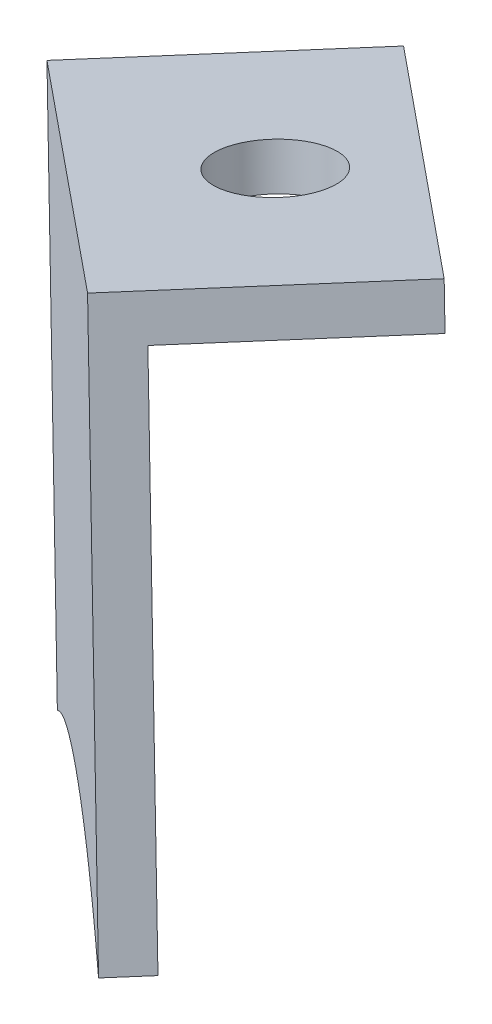
ISO-10303-21;
HEADER;
FILE_DESCRIPTION(('STEP AP214'),'2;1');
FILE_NAME('part.step','',(''),(''),'','','');
FILE_SCHEMA(('AUTOMOTIVE_DESIGN { 1 0 10303 214 1 1 1 1 }'));
ENDSEC;
DATA;
#1=APPLICATION_CONTEXT('core data for automotive mechanical design processes');
#2=APPLICATION_PROTOCOL_DEFINITION('international standard','automotive_design',2000,#1);
#3=PRODUCT_CONTEXT('',#1,'mechanical');
#4=PRODUCT('Part','Part','',(#3));
#5=PRODUCT_RELATED_PRODUCT_CATEGORY('part','',(#4));
#6=PRODUCT_DEFINITION_FORMATION('','',#4);
#7=PRODUCT_DEFINITION_CONTEXT('part definition',#1,'design');
#8=PRODUCT_DEFINITION('design','',#6,#7);
#9=PRODUCT_DEFINITION_SHAPE('','',#8);
#10=(LENGTH_UNIT() NAMED_UNIT(*) SI_UNIT(.MILLI.,.METRE.));
#11=(NAMED_UNIT(*) PLANE_ANGLE_UNIT() SI_UNIT($,.RADIAN.));
#12=(NAMED_UNIT(*) SI_UNIT($,.STERADIAN.) SOLID_ANGLE_UNIT());
#13=UNCERTAINTY_MEASURE_WITH_UNIT(LENGTH_MEASURE(1.E-05),#10,'distance_accuracy_value','');
#14=(GEOMETRIC_REPRESENTATION_CONTEXT(3) GLOBAL_UNCERTAINTY_ASSIGNED_CONTEXT((#13)) GLOBAL_UNIT_ASSIGNED_CONTEXT((#10,
#11,#12)) REPRESENTATION_CONTEXT('',''));
#15=CARTESIAN_POINT('',(0.,0.,0.));
#16=DIRECTION('',(0.,0.,1.));
#17=DIRECTION('',(1.,0.,0.));
#18=AXIS2_PLACEMENT_3D('',#15,#16,#17);
#19=CARTESIAN_POINT('',(909.399199225308,-359.189028773466,416.160760837431));
#20=DIRECTION('',(0.656059028990508,0.,-0.754709580222772));
#21=DIRECTION('',(-0.754709580222772,0.,-0.656059028990508));
#22=AXIS2_PLACEMENT_3D('',#19,#20,#21);
#23=PLANE('',#22);
#24=DIRECTION('',(-0.159336639189074,0.97745947709662,-0.138509227295271));
#25=VECTOR('',#24,1.);
#26=CARTESIAN_POINT('',(914.320802830597,-343.23861305799,420.439045580297));
#27=LINE('',#26,#25);
#28=CARTESIAN_POINT('',(914.320802830597,-343.23861305799,420.439045580297));
#29=VERTEX_POINT('',#28);
#30=CARTESIAN_POINT('',(910.858746443077,-322.000435552509,417.429525877054));
#31=VERTEX_POINT('',#30);
#32=EDGE_CURVE('E52',#29,#31,#27,.T.);
#33=ORIENTED_EDGE('',*,*,#32,.T.);
#34=DIRECTION('',(-0.73769803164436,-0.211123117242059,-0.641271115421576));
#35=VECTOR('',#34,1.);
#36=CARTESIAN_POINT('',(925.612707075965,-317.777973207667,430.254948185486));
#37=LINE('',#36,#35);
#38=CARTESIAN_POINT('',(925.612707075965,-317.777973207667,430.254948185486));
#39=VERTEX_POINT('',#38);
#40=EDGE_CURVE('E138',#39,#31,#37,.T.);
#41=ORIENTED_EDGE('',*,*,#40,.F.);
#42=DIRECTION('',(0.159336639189074,-0.97745947709662,0.138509227295272));
#43=VECTOR('',#42,1.);
#44=CARTESIAN_POINT('',(929.277449777312,-340.25954118089,433.440660413277));
#45=LINE('',#44,#43);
#46=CARTESIAN_POINT('',(929.277449777312,-340.25954118089,433.440660413277));
#47=VERTEX_POINT('',#46);
#48=EDGE_CURVE('E58',#39,#47,#45,.T.);
#49=ORIENTED_EDGE('',*,*,#48,.T.);
#50=CARTESIAN_POINT('',(933.22503689066,-345.357596421036,436.872245537284));
#51=CARTESIAN_POINT('',(925.653414901661,-322.458928477497,430.290334958489));
#52=CARTESIAN_POINT('',(901.827577236309,-336.290360829927,409.578850258637));
#53=CARTESIAN_POINT('',(909.399199225308,-359.189028773466,416.160760837431));
#54=CARTESIAN_POINT('',(916.970821214307,-382.087696717005,422.742671416226));
#55=CARTESIAN_POINT('',(940.796658879659,-368.256264364575,443.454156116079));
#56=CARTESIAN_POINT('',(933.22503689066,-345.357596421036,436.872245537284));
#57=(BOUNDED_CURVE() B_SPLINE_CURVE(3,(#50,#51,#52,#53,#54,#55,#56),.UNSPECIFIED.,.T.,
.F.) B_SPLINE_CURVE_WITH_KNOTS((4,3,4),(0.,0.5,1.),
.UNSPECIFIED.) CURVE() GEOMETRIC_REPRESENTATION_ITEM() RATIONAL_B_SPLINE_CURVE((1.,
0.333333333333333,0.333333333333333,1.,0.333333333333333,0.333333333333333,1.)) REPRESENTATION_ITEM(''));
#58=EDGE_CURVE('E88',#47,#29,#57,.T.);
#59=ORIENTED_EDGE('',*,*,#58,.T.);
#60=EDGE_LOOP('',(#33,#41,#49,#59));
#61=FACE_BOUND('',#60,.T.);
#62=ADVANCED_FACE('F36',(#61),#23,.T.);
#63=DIRECTION('',(-0.656059028990508,0.,0.754709580222771));
#64=VECTOR('',#63,1.);
#65=SURFACE_OF_LINEAR_EXTRUSION('',#57,#64);
#66=CARTESIAN_POINT('',(931.912918832679,-345.357596421036,438.38166469773));
#67=CARTESIAN_POINT('',(924.341296843679,-322.458928477497,431.799754118935));
#68=CARTESIAN_POINT('',(900.515459178327,-336.290360829927,411.088269419082));
#69=CARTESIAN_POINT('',(908.087081167327,-359.189028773466,417.670179997877));
#70=CARTESIAN_POINT('',(915.658703156326,-382.087696717005,424.252090576672));
#71=CARTESIAN_POINT('',(939.484540821678,-368.256264364575,444.963575276524));
#72=CARTESIAN_POINT('',(931.912918832679,-345.357596421036,438.38166469773));
#73=(BOUNDED_CURVE() B_SPLINE_CURVE(3,(#66,#67,#68,#69,#70,#71,#72),.UNSPECIFIED.,.T.,
.F.) B_SPLINE_CURVE_WITH_KNOTS((4,3,4),(0.,0.5,1.),
.UNSPECIFIED.) CURVE() GEOMETRIC_REPRESENTATION_ITEM() RATIONAL_B_SPLINE_CURVE((1.,
0.333333333333333,0.333333333333333,1.,0.333333333333333,0.333333333333333,1.)) REPRESENTATION_ITEM(''));
#74=CARTESIAN_POINT('',(927.965331719331,-340.25954118089,434.950079573723));
#75=VERTEX_POINT('',#74);
#76=CARTESIAN_POINT('',(913.008684772616,-343.23861305799,421.948464740743));
#77=VERTEX_POINT('',#76);
#78=EDGE_CURVE('E94',#75,#77,#73,.T.);
#79=ORIENTED_EDGE('',*,*,#78,.T.);
#80=DIRECTION('',(-0.656059028990508,0.,0.754709580222771));
#81=VECTOR('',#80,1.);
#82=CARTESIAN_POINT('',(914.320802830597,-343.23861305799,420.439045580297));
#83=LINE('',#82,#81);
#84=EDGE_CURVE('E11',#29,#77,#83,.T.);
#85=ORIENTED_EDGE('',*,*,#84,.F.);
#86=ORIENTED_EDGE('',*,*,#58,.F.);
#87=DIRECTION('',(-0.656059028990508,0.,0.754709580222771));
#88=VECTOR('',#87,1.);
#89=CARTESIAN_POINT('',(929.277449777312,-340.25954118089,433.440660413277));
#90=LINE('',#89,#88);
#91=EDGE_CURVE('E80',#47,#75,#90,.T.);
#92=ORIENTED_EDGE('',*,*,#91,.T.);
#93=EDGE_LOOP('',(#79,#85,#86,#92));
#94=FACE_BOUND('',#93,.T.);
#95=ADVANCED_FACE('F38',(#94),#65,.F.);
#96=CARTESIAN_POINT('',(914.320802830597,-343.23861305799,420.439045580297));
#97=DIRECTION('',(0.737698031644359,0.211123117242054,0.641271115421579));
#98=DIRECTION('',(0.656059028990508,0.,-0.754709580222771));
#99=AXIS2_PLACEMENT_3D('',#96,#97,#98);
#100=PLANE('',#99);
#101=DIRECTION('',(-0.159336639189074,0.97745947709662,-0.138509227295271));
#102=VECTOR('',#101,1.);
#103=CARTESIAN_POINT('',(913.008684772616,-343.23861305799,421.948464740743));
#104=LINE('',#103,#102);
#105=CARTESIAN_POINT('',(909.227955106717,-320.045516598315,418.661926582909));
#106=VERTEX_POINT('',#105);
#107=EDGE_CURVE('E97',#77,#106,#104,.T.);
#108=ORIENTED_EDGE('',*,*,#107,.T.);
#109=DIRECTION('',(-0.656059028990508,0.,0.754709580222771));
#110=VECTOR('',#109,1.);
#111=CARTESIAN_POINT('',(910.540073164698,-320.045516598315,417.152507422464));
#112=LINE('',#111,#110);
#113=CARTESIAN_POINT('',(917.100663454605,-320.045516598315,409.605411620236));
#114=VERTEX_POINT('',#113);
#115=EDGE_CURVE('E45',#114,#106,#112,.T.);
#116=ORIENTED_EDGE('',*,*,#115,.F.);
#117=DIRECTION('',(0.159336639189084,-0.977459477096616,0.138509227295289));
#118=VECTOR('',#117,1.);
#119=CARTESIAN_POINT('',(917.100663454605,-320.045516598315,409.605411620236));
#120=LINE('',#119,#118);
#121=CARTESIAN_POINT('',(917.419336732983,-322.000435552509,409.882430074827));
#122=VERTEX_POINT('',#121);
#123=EDGE_CURVE('E125',#114,#122,#120,.T.);
#124=ORIENTED_EDGE('',*,*,#123,.T.);
#125=DIRECTION('',(-0.656059028990508,0.,0.754709580222772));
#126=VECTOR('',#125,1.);
#127=CARTESIAN_POINT('',(917.419336732983,-322.000435552509,409.882430074827));
#128=LINE('',#127,#126);
#129=EDGE_CURVE('E98',#122,#31,#128,.T.);
#130=ORIENTED_EDGE('',*,*,#129,.T.);
#131=ORIENTED_EDGE('',*,*,#32,.F.);
#132=ORIENTED_EDGE('',*,*,#84,.T.);
#133=EDGE_LOOP('',(#108,#116,#124,#130,#131,#132));
#134=FACE_BOUND('',#133,.T.);
#135=ADVANCED_FACE('F123',(#134),#100,.F.);
#136=CARTESIAN_POINT('',(925.294033797586,-315.823054253474,429.977929730895));
#137=DIRECTION('',(0.159336639189076,-0.977459477096619,0.138509227295273));
#138=DIRECTION('',(0.986972766259254,0.160887409894487,0.));
#139=AXIS2_PLACEMENT_3D('',#136,#137,#138);
#140=PLANE('',#139);
#141=CARTESIAN_POINT('',(921.197348626095,-317.934285425895,419.791670675566));
#142=DIRECTION('',(0.159336639189076,-0.977459477096619,0.138509227295273));
#143=DIRECTION('',(0.986972766259254,0.160887409894487,0.));
#144=AXIS2_PLACEMENT_3D('',#141,#142,#143);
#145=CIRCLE('',#144,2.49999999999987);
#146=CARTESIAN_POINT('',(923.664780541743,-317.532066901158,419.791670675566));
#147=VERTEX_POINT('',#146);
#148=EDGE_CURVE('E145',#147,#147,#145,.T.);
#149=ORIENTED_EDGE('',*,*,#148,.T.);
#150=EDGE_LOOP('',(#149));
#151=FACE_BOUND('',#150,.T.);
#152=DIRECTION('',(0.737698031644359,0.211123117242057,0.641271115421578));
#153=VECTOR('',#152,1.);
#154=CARTESIAN_POINT('',(923.981915739605,-315.823054253474,431.487348891341));
#155=LINE('',#154,#153);
#156=CARTESIAN_POINT('',(923.981915739605,-315.823054253474,431.487348891341));
#157=VERTEX_POINT('',#156);
#158=EDGE_CURVE('E89',#106,#157,#155,.T.);
#159=ORIENTED_EDGE('',*,*,#158,.T.);
#160=DIRECTION('',(-0.656059028990508,0.,0.754709580222771));
#161=VECTOR('',#160,1.);
#162=CARTESIAN_POINT('',(925.294033797586,-315.823054253474,429.977929730895));
#163=LINE('',#162,#161);
#164=CARTESIAN_POINT('',(931.854624087492,-315.823054253474,422.430833928667));
#165=VERTEX_POINT('',#164);
#166=EDGE_CURVE('E84',#165,#157,#163,.T.);
#167=ORIENTED_EDGE('',*,*,#166,.F.);
#168=DIRECTION('',(-0.737698031644364,-0.211123117242059,-0.641271115421572));
#169=VECTOR('',#168,1.);
#170=CARTESIAN_POINT('',(931.854624087492,-315.823054253474,422.430833928667));
#171=LINE('',#170,#169);
#172=EDGE_CURVE('E119',#165,#114,#171,.T.);
#173=ORIENTED_EDGE('',*,*,#172,.T.);
#174=ORIENTED_EDGE('',*,*,#115,.T.);
#175=EDGE_LOOP('',(#159,#167,#173,#174));
#176=FACE_BOUND('',#175,.T.);
#177=ADVANCED_FACE('F116',(#151,#176),#140,.F.);
#178=CARTESIAN_POINT('',(929.277449777312,-340.25954118089,433.440660413277));
#179=DIRECTION('',(-0.737698031644359,-0.211123117242055,-0.641271115421579));
#180=DIRECTION('',(-0.656059028990508,0.,0.754709580222771));
#181=AXIS2_PLACEMENT_3D('',#178,#179,#180);
#182=PLANE('',#181);
#183=DIRECTION('',(0.159336639189074,-0.97745947709662,0.138509227295272));
#184=VECTOR('',#183,1.);
#185=CARTESIAN_POINT('',(927.965331719331,-340.25954118089,434.950079573723));
#186=LINE('',#185,#184);
#187=EDGE_CURVE('E77',#157,#75,#186,.T.);
#188=ORIENTED_EDGE('',*,*,#187,.T.);
#189=ORIENTED_EDGE('',*,*,#91,.F.);
#190=ORIENTED_EDGE('',*,*,#48,.F.);
#191=DIRECTION('',(-0.656059028990508,0.,0.754709580222772));
#192=VECTOR('',#191,1.);
#193=CARTESIAN_POINT('',(932.17329736587,-317.777973207667,422.707852383258));
#194=LINE('',#193,#192);
#195=CARTESIAN_POINT('',(932.17329736587,-317.777973207667,422.707852383258));
#196=VERTEX_POINT('',#195);
#197=EDGE_CURVE('E101',#196,#39,#194,.T.);
#198=ORIENTED_EDGE('',*,*,#197,.F.);
#199=DIRECTION('',(-0.159336639189088,0.977459477096615,-0.138509227295293));
#200=VECTOR('',#199,1.);
#201=CARTESIAN_POINT('',(932.17329736587,-317.777973207667,422.707852383258));
#202=LINE('',#201,#200);
#203=EDGE_CURVE('E136',#196,#165,#202,.T.);
#204=ORIENTED_EDGE('',*,*,#203,.T.);
#205=ORIENTED_EDGE('',*,*,#166,.T.);
#206=EDGE_LOOP('',(#188,#189,#190,#198,#204,#205));
#207=FACE_BOUND('',#206,.T.);
#208=ADVANCED_FACE('F79',(#207),#182,.F.);
#209=CARTESIAN_POINT('',(908.087081167327,-359.189028773466,417.670179997877));
#210=DIRECTION('',(0.656059028990508,0.,-0.754709580222772));
#211=DIRECTION('',(-0.754709580222772,0.,-0.656059028990508));
#212=AXIS2_PLACEMENT_3D('',#209,#210,#211);
#213=PLANE('',#212);
#214=ORIENTED_EDGE('',*,*,#78,.F.);
#215=ORIENTED_EDGE('',*,*,#187,.F.);
#216=ORIENTED_EDGE('',*,*,#158,.F.);
#217=ORIENTED_EDGE('',*,*,#107,.F.);
#218=EDGE_LOOP('',(#214,#215,#216,#217));
#219=FACE_BOUND('',#218,.T.);
#220=ADVANCED_FACE('F96',(#219),#213,.F.);
#221=CARTESIAN_POINT('',(932.17329736587,-317.777973207667,422.707852383258));
#222=DIRECTION('',(-0.159336639189073,0.977459477096619,-0.13850922729528));
#223=DIRECTION('',(-0.986972766259254,-0.160887409894484,0.));
#224=AXIS2_PLACEMENT_3D('',#221,#222,#223);
#225=PLANE('',#224);
#226=CARTESIAN_POINT('',(921.516021904474,-319.889204380088,420.068689130156));
#227=DIRECTION('',(0.159336639189073,-0.977459477096619,0.138509227295279));
#228=DIRECTION('',(0.986972766259254,0.160887409894484,0.));
#229=AXIS2_PLACEMENT_3D('',#226,#227,#228);
#230=CIRCLE('',#229,2.49999999999987);
#231=CARTESIAN_POINT('',(923.983453820122,-319.486985855352,420.068689130156));
#232=VERTEX_POINT('',#231);
#233=EDGE_CURVE('E232',#232,#232,#230,.T.);
#234=ORIENTED_EDGE('',*,*,#233,.F.);
#235=EDGE_LOOP('',(#234));
#236=FACE_BOUND('',#235,.T.);
#237=ORIENTED_EDGE('',*,*,#40,.T.);
#238=ORIENTED_EDGE('',*,*,#129,.F.);
#239=DIRECTION('',(-0.73769803164436,-0.211123117242059,-0.641271115421576));
#240=VECTOR('',#239,1.);
#241=CARTESIAN_POINT('',(932.17329736587,-317.777973207667,422.707852383258));
#242=LINE('',#241,#240);
#243=EDGE_CURVE('E133',#196,#122,#242,.T.);
#244=ORIENTED_EDGE('',*,*,#243,.F.);
#245=ORIENTED_EDGE('',*,*,#197,.T.);
#246=EDGE_LOOP('',(#237,#238,#244,#245));
#247=FACE_BOUND('',#246,.T.);
#248=ADVANCED_FACE('F154',(#236,#247),#225,.F.);
#249=CARTESIAN_POINT('',(191.922880158915,-2.09076071398229E-12,-220.78201795768));
#250=DIRECTION('',(-0.656059028990508,0.,0.754709580222772));
#251=DIRECTION('',(0.754709580222772,0.,0.656059028990508));
#252=AXIS2_PLACEMENT_3D('',#249,#250,#251);
#253=PLANE('',#252);
#254=ORIENTED_EDGE('',*,*,#243,.T.);
#255=ORIENTED_EDGE('',*,*,#123,.F.);
#256=ORIENTED_EDGE('',*,*,#172,.F.);
#257=ORIENTED_EDGE('',*,*,#203,.F.);
#258=EDGE_LOOP('',(#254,#255,#256,#257));
#259=FACE_BOUND('',#258,.T.);
#260=ADVANCED_FACE('F130',(#259),#253,.F.);
#261=CARTESIAN_POINT('',(919.922655512583,-310.114609609122,418.683596857203));
#262=DIRECTION('',(0.159336639189073,-0.977459477096619,0.138509227295279));
#263=DIRECTION('',(0.986972766259254,0.160887409894484,0.));
#264=AXIS2_PLACEMENT_3D('',#261,#262,#263);
#265=CYLINDRICAL_SURFACE('',#264,2.49999999999987);
#266=ORIENTED_EDGE('',*,*,#233,.T.);
#267=EDGE_LOOP('',(#266));
#268=FACE_BOUND('',#267,.T.);
#269=ORIENTED_EDGE('',*,*,#148,.F.);
#270=EDGE_LOOP('',(#269));
#271=FACE_BOUND('',#270,.T.);
#272=ADVANCED_FACE('F167',(#268,#271),#265,.F.);
#273=CLOSED_SHELL('',(#62,#95,#135,#177,#208,#220,#248,#260,#272));
#274=MANIFOLD_SOLID_BREP('B2',#273);
#275=ADVANCED_BREP_SHAPE_REPRESENTATION('',(#18,#274),#14);
#276=SHAPE_DEFINITION_REPRESENTATION(#9,#275);
ENDSEC;
END-ISO-10303-21;
